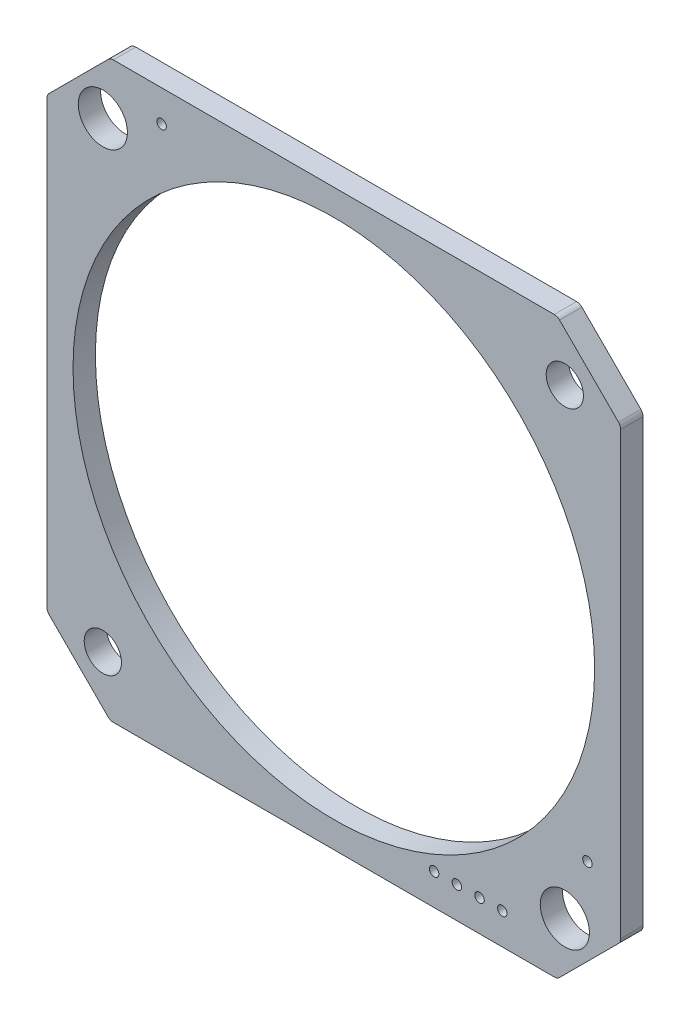
ISO-10303-21;
HEADER;
FILE_DESCRIPTION(('STEP AP214'),'2;1');
FILE_NAME('part.step','',(''),(''),'','','');
FILE_SCHEMA(('AUTOMOTIVE_DESIGN { 1 0 10303 214 1 1 1 1 }'));
ENDSEC;
DATA;
#1=APPLICATION_CONTEXT('core data for automotive mechanical design processes');
#2=APPLICATION_PROTOCOL_DEFINITION('international standard','automotive_design',2000,#1);
#3=PRODUCT_CONTEXT('',#1,'mechanical');
#4=PRODUCT('Part','Part','',(#3));
#5=PRODUCT_RELATED_PRODUCT_CATEGORY('part','',(#4));
#6=PRODUCT_DEFINITION_FORMATION('','',#4);
#7=PRODUCT_DEFINITION_CONTEXT('part definition',#1,'design');
#8=PRODUCT_DEFINITION('design','',#6,#7);
#9=PRODUCT_DEFINITION_SHAPE('','',#8);
#10=(LENGTH_UNIT() NAMED_UNIT(*) SI_UNIT(.MILLI.,.METRE.));
#11=(NAMED_UNIT(*) PLANE_ANGLE_UNIT() SI_UNIT($,.RADIAN.));
#12=(NAMED_UNIT(*) SI_UNIT($,.STERADIAN.) SOLID_ANGLE_UNIT());
#13=UNCERTAINTY_MEASURE_WITH_UNIT(LENGTH_MEASURE(1.E-05),#10,'distance_accuracy_value','');
#14=(GEOMETRIC_REPRESENTATION_CONTEXT(3) GLOBAL_UNCERTAINTY_ASSIGNED_CONTEXT((#13)) GLOBAL_UNIT_ASSIGNED_CONTEXT((#10,
#11,#12)) REPRESENTATION_CONTEXT('',''));
#15=CARTESIAN_POINT('',(0.,0.,0.));
#16=DIRECTION('',(0.,0.,1.));
#17=DIRECTION('',(1.,0.,0.));
#18=AXIS2_PLACEMENT_3D('',#15,#16,#17);
#19=CARTESIAN_POINT('',(0.,0.,-0.75));
#20=DIRECTION('',(0.,0.,1.));
#21=DIRECTION('',(1.,0.,0.));
#22=AXIS2_PLACEMENT_3D('',#19,#20,#21);
#23=PLANE('',#22);
#24=CARTESIAN_POINT('',(-18.75,14.79289321881,-0.75));
#25=DIRECTION('',(0.,0.,-1.));
#26=DIRECTION('',(-1.,0.,0.));
#27=AXIS2_PLACEMENT_3D('',#24,#25,#26);
#28=CIRCLE('',#27,0.5);
#29=CARTESIAN_POINT('',(-19.25,14.79289321881,-0.75));
#30=VERTEX_POINT('',#29);
#31=CARTESIAN_POINT('',(-19.10355339059,15.14644660941,-0.75));
#32=VERTEX_POINT('',#31);
#33=EDGE_CURVE('E10',#30,#32,#28,.T.);
#34=ORIENTED_EDGE('',*,*,#33,.T.);
#35=DIRECTION('',(-0.707106781186598,-0.707106781186498,0.));
#36=VECTOR('',#35,1.);
#37=CARTESIAN_POINT('',(-15.14644660941,19.10355339059,-0.75));
#38=LINE('',#37,#36);
#39=CARTESIAN_POINT('',(-15.14644660941,19.10355339059,-0.75));
#40=VERTEX_POINT('',#39);
#41=EDGE_CURVE('E35',#40,#32,#38,.T.);
#42=ORIENTED_EDGE('',*,*,#41,.F.);
#43=CARTESIAN_POINT('',(-14.79289321881,18.75,-0.75));
#44=DIRECTION('',(0.,0.,-1.));
#45=DIRECTION('',(-0.707106781186498,0.707106781186598,0.));
#46=AXIS2_PLACEMENT_3D('',#43,#44,#45);
#47=CIRCLE('',#46,0.5);
#48=CARTESIAN_POINT('',(-14.79289321881,19.25,-0.75));
#49=VERTEX_POINT('',#48);
#50=EDGE_CURVE('E26',#40,#49,#47,.T.);
#51=ORIENTED_EDGE('',*,*,#50,.T.);
#52=DIRECTION('',(-1.,0.,0.));
#53=VECTOR('',#52,1.);
#54=CARTESIAN_POINT('',(14.79289321881,19.25,-0.75));
#55=LINE('',#54,#53);
#56=CARTESIAN_POINT('',(14.79289321881,19.25,-0.75));
#57=VERTEX_POINT('',#56);
#58=EDGE_CURVE('E169',#57,#49,#55,.T.);
#59=ORIENTED_EDGE('',*,*,#58,.F.);
#60=CARTESIAN_POINT('',(14.79289321881,18.75,-0.75));
#61=DIRECTION('',(0.,0.,-1.));
#62=DIRECTION('',(0.,1.,0.));
#63=AXIS2_PLACEMENT_3D('',#60,#61,#62);
#64=CIRCLE('',#63,0.5);
#65=CARTESIAN_POINT('',(15.14644660941,19.10355339059,-0.75));
#66=VERTEX_POINT('',#65);
#67=EDGE_CURVE('E447',#57,#66,#64,.T.);
#68=ORIENTED_EDGE('',*,*,#67,.T.);
#69=DIRECTION('',(-0.707106781186498,0.707106781186598,0.));
#70=VECTOR('',#69,1.);
#71=CARTESIAN_POINT('',(19.10355339059,15.14644660941,-0.75));
#72=LINE('',#71,#70);
#73=CARTESIAN_POINT('',(19.10355339059,15.14644660941,-0.75));
#74=VERTEX_POINT('',#73);
#75=EDGE_CURVE('E173',#74,#66,#72,.T.);
#76=ORIENTED_EDGE('',*,*,#75,.F.);
#77=CARTESIAN_POINT('',(18.75,14.79289321881,-0.75));
#78=DIRECTION('',(0.,0.,-1.));
#79=DIRECTION('',(0.707106781186598,0.707106781186498,0.));
#80=AXIS2_PLACEMENT_3D('',#77,#78,#79);
#81=CIRCLE('',#80,0.5);
#82=CARTESIAN_POINT('',(19.25,14.79289321881,-0.75));
#83=VERTEX_POINT('',#82);
#84=EDGE_CURVE('E440',#74,#83,#81,.T.);
#85=ORIENTED_EDGE('',*,*,#84,.T.);
#86=DIRECTION('',(0.,1.,0.));
#87=VECTOR('',#86,1.);
#88=CARTESIAN_POINT('',(19.25,-14.79289321881,-0.75));
#89=LINE('',#88,#87);
#90=CARTESIAN_POINT('',(19.25,-14.79289321881,-0.75));
#91=VERTEX_POINT('',#90);
#92=EDGE_CURVE('E183',#91,#83,#89,.T.);
#93=ORIENTED_EDGE('',*,*,#92,.F.);
#94=CARTESIAN_POINT('',(18.75,-14.79289321881,-0.75));
#95=DIRECTION('',(0.,0.,-1.));
#96=DIRECTION('',(1.,0.,0.));
#97=AXIS2_PLACEMENT_3D('',#94,#95,#96);
#98=CIRCLE('',#97,0.5);
#99=CARTESIAN_POINT('',(19.10355339059,-15.14644660941,-0.75));
#100=VERTEX_POINT('',#99);
#101=EDGE_CURVE('E436',#91,#100,#98,.T.);
#102=ORIENTED_EDGE('',*,*,#101,.T.);
#103=DIRECTION('',(0.707106781186498,0.707106781186598,0.));
#104=VECTOR('',#103,1.);
#105=CARTESIAN_POINT('',(15.14644660941,-19.10355339059,-0.75));
#106=LINE('',#105,#104);
#107=CARTESIAN_POINT('',(15.14644660941,-19.10355339059,-0.75));
#108=VERTEX_POINT('',#107);
#109=EDGE_CURVE('E190',#108,#100,#106,.T.);
#110=ORIENTED_EDGE('',*,*,#109,.F.);
#111=CARTESIAN_POINT('',(14.79289321881,-18.75,-0.75));
#112=DIRECTION('',(0.,0.,-1.));
#113=DIRECTION('',(0.707106781186598,-0.707106781186498,0.));
#114=AXIS2_PLACEMENT_3D('',#111,#112,#113);
#115=CIRCLE('',#114,0.5);
#116=CARTESIAN_POINT('',(14.79289321881,-19.25,-0.75));
#117=VERTEX_POINT('',#116);
#118=EDGE_CURVE('E435',#108,#117,#115,.T.);
#119=ORIENTED_EDGE('',*,*,#118,.T.);
#120=DIRECTION('',(1.,0.,0.));
#121=VECTOR('',#120,1.);
#122=CARTESIAN_POINT('',(-14.79289321881,-19.25,-0.75));
#123=LINE('',#122,#121);
#124=CARTESIAN_POINT('',(-14.79289321881,-19.25,-0.75));
#125=VERTEX_POINT('',#124);
#126=EDGE_CURVE('E196',#125,#117,#123,.T.);
#127=ORIENTED_EDGE('',*,*,#126,.F.);
#128=CARTESIAN_POINT('',(-14.79289321881,-18.75,-0.75));
#129=DIRECTION('',(0.,0.,-1.));
#130=DIRECTION('',(0.,-1.,0.));
#131=AXIS2_PLACEMENT_3D('',#128,#129,#130);
#132=CIRCLE('',#131,0.5);
#133=CARTESIAN_POINT('',(-15.14644660941,-19.10355339059,-0.75));
#134=VERTEX_POINT('',#133);
#135=EDGE_CURVE('E211',#125,#134,#132,.T.);
#136=ORIENTED_EDGE('',*,*,#135,.T.);
#137=DIRECTION('',(0.707106781186498,-0.707106781186598,0.));
#138=VECTOR('',#137,1.);
#139=CARTESIAN_POINT('',(-19.10355339059,-15.14644660941,-0.75));
#140=LINE('',#139,#138);
#141=CARTESIAN_POINT('',(-19.10355339059,-15.14644660941,-0.75));
#142=VERTEX_POINT('',#141);
#143=EDGE_CURVE('E204',#142,#134,#140,.T.);
#144=ORIENTED_EDGE('',*,*,#143,.F.);
#145=CARTESIAN_POINT('',(-18.75,-14.79289321881,-0.75));
#146=DIRECTION('',(0.,0.,-1.));
#147=DIRECTION('',(-0.707106781186598,-0.707106781186498,0.));
#148=AXIS2_PLACEMENT_3D('',#145,#146,#147);
#149=CIRCLE('',#148,0.5);
#150=CARTESIAN_POINT('',(-19.25,-14.79289321881,-0.75));
#151=VERTEX_POINT('',#150);
#152=EDGE_CURVE('E212',#142,#151,#149,.T.);
#153=ORIENTED_EDGE('',*,*,#152,.T.);
#154=DIRECTION('',(0.,-1.,0.));
#155=VECTOR('',#154,1.);
#156=CARTESIAN_POINT('',(-19.25,14.79289321881,-0.75));
#157=LINE('',#156,#155);
#158=EDGE_CURVE('E150',#30,#151,#157,.T.);
#159=ORIENTED_EDGE('',*,*,#158,.F.);
#160=EDGE_LOOP('',(#34,#42,#51,#59,#68,#76,#85,#93,#102,#110,#119,#127,#136,#144,#153,#159));
#161=FACE_BOUND('',#160,.T.);
#162=CARTESIAN_POINT('',(8.254898,-17.14503,-0.75));
#163=DIRECTION('',(0.,0.,-1.));
#164=DIRECTION('',(-1.,0.,0.));
#165=AXIS2_PLACEMENT_3D('',#162,#163,#164);
#166=CIRCLE('',#165,0.3175);
#167=CARTESIAN_POINT('',(7.937398,-17.14503,-0.75));
#168=VERTEX_POINT('',#167);
#169=EDGE_CURVE('E216',#168,#168,#166,.T.);
#170=ORIENTED_EDGE('',*,*,#169,.F.);
#171=EDGE_LOOP('',(#170));
#172=FACE_BOUND('',#171,.T.);
#173=CARTESIAN_POINT('',(17.017898,-11.43003,-0.75));
#174=DIRECTION('',(0.,0.,-1.));
#175=DIRECTION('',(-1.,0.,0.));
#176=AXIS2_PLACEMENT_3D('',#173,#174,#175);
#177=CIRCLE('',#176,0.3175);
#178=CARTESIAN_POINT('',(16.700398,-11.43003,-0.75));
#179=VERTEX_POINT('',#178);
#180=EDGE_CURVE('E220',#179,#179,#177,.T.);
#181=ORIENTED_EDGE('',*,*,#180,.F.);
#182=EDGE_LOOP('',(#181));
#183=FACE_BOUND('',#182,.T.);
#184=CARTESIAN_POINT('',(-11.557102,17.14497,-0.75));
#185=DIRECTION('',(0.,0.,-1.));
#186=DIRECTION('',(-1.,0.,0.));
#187=AXIS2_PLACEMENT_3D('',#184,#185,#186);
#188=CIRCLE('',#187,0.3175);
#189=CARTESIAN_POINT('',(-11.874602,17.14497,-0.75));
#190=VERTEX_POINT('',#189);
#191=EDGE_CURVE('E223',#190,#190,#188,.T.);
#192=ORIENTED_EDGE('',*,*,#191,.F.);
#193=EDGE_LOOP('',(#192));
#194=FACE_BOUND('',#193,.T.);
#195=CARTESIAN_POINT('',(9.778898,-17.14503,-0.75));
#196=DIRECTION('',(0.,0.,-1.));
#197=DIRECTION('',(-1.,0.,0.));
#198=AXIS2_PLACEMENT_3D('',#195,#196,#197);
#199=CIRCLE('',#198,0.3175);
#200=CARTESIAN_POINT('',(9.461398,-17.14503,-0.75));
#201=VERTEX_POINT('',#200);
#202=EDGE_CURVE('E226',#201,#201,#199,.T.);
#203=ORIENTED_EDGE('',*,*,#202,.F.);
#204=EDGE_LOOP('',(#203));
#205=FACE_BOUND('',#204,.T.);
#206=CARTESIAN_POINT('',(11.302898,-17.14503,-0.75));
#207=DIRECTION('',(0.,0.,-1.));
#208=DIRECTION('',(-1.,0.,0.));
#209=AXIS2_PLACEMENT_3D('',#206,#207,#208);
#210=CIRCLE('',#209,0.3175);
#211=CARTESIAN_POINT('',(10.985398,-17.14503,-0.75));
#212=VERTEX_POINT('',#211);
#213=EDGE_CURVE('E229',#212,#212,#210,.T.);
#214=ORIENTED_EDGE('',*,*,#213,.F.);
#215=EDGE_LOOP('',(#214));
#216=FACE_BOUND('',#215,.T.);
#217=CARTESIAN_POINT('',(-15.5,15.5,-0.75));
#218=DIRECTION('',(0.,0.,-1.));
#219=DIRECTION('',(-1.,0.,0.));
#220=AXIS2_PLACEMENT_3D('',#217,#218,#219);
#221=CIRCLE('',#220,1.65);
#222=CARTESIAN_POINT('',(-17.15,15.5,-0.75));
#223=VERTEX_POINT('',#222);
#224=EDGE_CURVE('E232',#223,#223,#221,.T.);
#225=ORIENTED_EDGE('',*,*,#224,.F.);
#226=EDGE_LOOP('',(#225));
#227=FACE_BOUND('',#226,.T.);
#228=CARTESIAN_POINT('',(15.5,-15.5,-0.75));
#229=DIRECTION('',(0.,0.,-1.));
#230=DIRECTION('',(-1.,0.,0.));
#231=AXIS2_PLACEMENT_3D('',#228,#229,#230);
#232=CIRCLE('',#231,1.65);
#233=CARTESIAN_POINT('',(13.85,-15.5,-0.75));
#234=VERTEX_POINT('',#233);
#235=EDGE_CURVE('E235',#234,#234,#232,.T.);
#236=ORIENTED_EDGE('',*,*,#235,.F.);
#237=EDGE_LOOP('',(#236));
#238=FACE_BOUND('',#237,.T.);
#239=CARTESIAN_POINT('',(6.730898,-17.14503,-0.75));
#240=DIRECTION('',(0.,0.,-1.));
#241=DIRECTION('',(-1.,0.,0.));
#242=AXIS2_PLACEMENT_3D('',#239,#240,#241);
#243=CIRCLE('',#242,0.3175);
#244=CARTESIAN_POINT('',(6.413398,-17.14503,-0.75));
#245=VERTEX_POINT('',#244);
#246=EDGE_CURVE('E238',#245,#245,#243,.T.);
#247=ORIENTED_EDGE('',*,*,#246,.F.);
#248=EDGE_LOOP('',(#247));
#249=FACE_BOUND('',#248,.T.);
#250=CARTESIAN_POINT('',(15.5,15.5,-0.75));
#251=DIRECTION('',(0.,0.,-1.));
#252=DIRECTION('',(1.,0.,0.));
#253=AXIS2_PLACEMENT_3D('',#250,#251,#252);
#254=CIRCLE('',#253,1.25);
#255=CARTESIAN_POINT('',(16.75,15.5,-0.75));
#256=VERTEX_POINT('',#255);
#257=EDGE_CURVE('E242',#256,#256,#254,.T.);
#258=ORIENTED_EDGE('',*,*,#257,.F.);
#259=EDGE_LOOP('',(#258));
#260=FACE_BOUND('',#259,.T.);
#261=CARTESIAN_POINT('',(-15.5,-15.5,-0.75));
#262=DIRECTION('',(0.,0.,-1.));
#263=DIRECTION('',(1.,0.,0.));
#264=AXIS2_PLACEMENT_3D('',#261,#262,#263);
#265=CIRCLE('',#264,1.25);
#266=CARTESIAN_POINT('',(-14.25,-15.5,-0.75));
#267=VERTEX_POINT('',#266);
#268=EDGE_CURVE('E149',#267,#267,#265,.T.);
#269=ORIENTED_EDGE('',*,*,#268,.F.);
#270=EDGE_LOOP('',(#269));
#271=FACE_BOUND('',#270,.T.);
#272=CARTESIAN_POINT('',(0.,0.,-0.75));
#273=DIRECTION('',(0.,0.,-1.));
#274=DIRECTION('',(-1.,0.,0.));
#275=AXIS2_PLACEMENT_3D('',#272,#273,#274);
#276=CIRCLE('',#275,17.5);
#277=CARTESIAN_POINT('',(-17.5,0.,-0.75));
#278=VERTEX_POINT('',#277);
#279=EDGE_CURVE('E214',#278,#278,#276,.T.);
#280=ORIENTED_EDGE('',*,*,#279,.F.);
#281=EDGE_LOOP('',(#280));
#282=FACE_BOUND('',#281,.T.);
#283=ADVANCED_FACE('F16',(#161,#172,#183,#194,#205,#216,#227,#238,#249,#260,#271,#282),#23,.F.);
#284=CARTESIAN_POINT('',(0.,0.,-0.75));
#285=DIRECTION('',(0.,0.,1.));
#286=DIRECTION('',(1.,0.,0.));
#287=AXIS2_PLACEMENT_3D('',#284,#285,#286);
#288=CYLINDRICAL_SURFACE('',#287,17.5);
#289=CARTESIAN_POINT('',(0.,0.,0.75));
#290=DIRECTION('',(0.,0.,-1.));
#291=DIRECTION('',(1.,0.,0.));
#292=AXIS2_PLACEMENT_3D('',#289,#290,#291);
#293=CIRCLE('',#292,17.5);
#294=CARTESIAN_POINT('',(17.5,0.,0.75));
#295=VERTEX_POINT('',#294);
#296=EDGE_CURVE('E219',#295,#295,#293,.T.);
#297=ORIENTED_EDGE('',*,*,#296,.F.);
#298=EDGE_LOOP('',(#297));
#299=FACE_BOUND('',#298,.T.);
#300=ORIENTED_EDGE('',*,*,#279,.T.);
#301=EDGE_LOOP('',(#300));
#302=FACE_BOUND('',#301,.T.);
#303=ADVANCED_FACE('F320',(#299,#302),#288,.F.);
#304=CARTESIAN_POINT('',(0.,0.,0.75));
#305=DIRECTION('',(0.,0.,1.));
#306=DIRECTION('',(1.,0.,0.));
#307=AXIS2_PLACEMENT_3D('',#304,#305,#306);
#308=PLANE('',#307);
#309=CARTESIAN_POINT('',(-18.75,-14.79289321881,0.75));
#310=DIRECTION('',(0.,0.,1.));
#311=DIRECTION('',(-1.,0.,0.));
#312=AXIS2_PLACEMENT_3D('',#309,#310,#311);
#313=CIRCLE('',#312,0.5);
#314=CARTESIAN_POINT('',(-19.25,-14.79289321881,0.75));
#315=VERTEX_POINT('',#314);
#316=CARTESIAN_POINT('',(-19.10355339059,-15.14644660941,0.75));
#317=VERTEX_POINT('',#316);
#318=EDGE_CURVE('E247',#315,#317,#313,.T.);
#319=ORIENTED_EDGE('',*,*,#318,.T.);
#320=DIRECTION('',(0.707106781186498,-0.707106781186598,0.));
#321=VECTOR('',#320,1.);
#322=CARTESIAN_POINT('',(-19.10355339059,-15.14644660941,0.75));
#323=LINE('',#322,#321);
#324=CARTESIAN_POINT('',(-15.14644660941,-19.10355339059,0.75));
#325=VERTEX_POINT('',#324);
#326=EDGE_CURVE('E252',#317,#325,#323,.T.);
#327=ORIENTED_EDGE('',*,*,#326,.T.);
#328=CARTESIAN_POINT('',(-14.79289321881,-18.75,0.75));
#329=DIRECTION('',(0.,0.,1.));
#330=DIRECTION('',(-0.707106781186598,-0.707106781186498,0.));
#331=AXIS2_PLACEMENT_3D('',#328,#329,#330);
#332=CIRCLE('',#331,0.5);
#333=CARTESIAN_POINT('',(-14.79289321881,-19.25,0.75));
#334=VERTEX_POINT('',#333);
#335=EDGE_CURVE('E255',#325,#334,#332,.T.);
#336=ORIENTED_EDGE('',*,*,#335,.T.);
#337=DIRECTION('',(1.,0.,0.));
#338=VECTOR('',#337,1.);
#339=CARTESIAN_POINT('',(-14.79289321881,-19.25,0.75));
#340=LINE('',#339,#338);
#341=CARTESIAN_POINT('',(14.79289321881,-19.25,0.75));
#342=VERTEX_POINT('',#341);
#343=EDGE_CURVE('E258',#334,#342,#340,.T.);
#344=ORIENTED_EDGE('',*,*,#343,.T.);
#345=CARTESIAN_POINT('',(14.79289321881,-18.75,0.75));
#346=DIRECTION('',(0.,0.,1.));
#347=DIRECTION('',(0.,-1.,0.));
#348=AXIS2_PLACEMENT_3D('',#345,#346,#347);
#349=CIRCLE('',#348,0.5);
#350=CARTESIAN_POINT('',(15.14644660941,-19.10355339059,0.75));
#351=VERTEX_POINT('',#350);
#352=EDGE_CURVE('E261',#342,#351,#349,.T.);
#353=ORIENTED_EDGE('',*,*,#352,.T.);
#354=DIRECTION('',(0.707106781186498,0.707106781186598,0.));
#355=VECTOR('',#354,1.);
#356=CARTESIAN_POINT('',(15.14644660941,-19.10355339059,0.75));
#357=LINE('',#356,#355);
#358=CARTESIAN_POINT('',(19.10355339059,-15.14644660941,0.75));
#359=VERTEX_POINT('',#358);
#360=EDGE_CURVE('E264',#351,#359,#357,.T.);
#361=ORIENTED_EDGE('',*,*,#360,.T.);
#362=CARTESIAN_POINT('',(18.75,-14.79289321881,0.75));
#363=DIRECTION('',(0.,0.,1.));
#364=DIRECTION('',(0.707106781186598,-0.707106781186498,0.));
#365=AXIS2_PLACEMENT_3D('',#362,#363,#364);
#366=CIRCLE('',#365,0.5);
#367=CARTESIAN_POINT('',(19.25,-14.79289321881,0.75));
#368=VERTEX_POINT('',#367);
#369=EDGE_CURVE('E267',#359,#368,#366,.T.);
#370=ORIENTED_EDGE('',*,*,#369,.T.);
#371=DIRECTION('',(0.,1.,0.));
#372=VECTOR('',#371,1.);
#373=CARTESIAN_POINT('',(19.25,-14.79289321881,0.75));
#374=LINE('',#373,#372);
#375=CARTESIAN_POINT('',(19.25,14.79289321881,0.75));
#376=VERTEX_POINT('',#375);
#377=EDGE_CURVE('E270',#368,#376,#374,.T.);
#378=ORIENTED_EDGE('',*,*,#377,.T.);
#379=CARTESIAN_POINT('',(18.75,14.79289321881,0.75));
#380=DIRECTION('',(0.,0.,1.));
#381=DIRECTION('',(1.,0.,0.));
#382=AXIS2_PLACEMENT_3D('',#379,#380,#381);
#383=CIRCLE('',#382,0.5);
#384=CARTESIAN_POINT('',(19.10355339059,15.14644660941,0.75));
#385=VERTEX_POINT('',#384);
#386=EDGE_CURVE('E273',#376,#385,#383,.T.);
#387=ORIENTED_EDGE('',*,*,#386,.T.);
#388=DIRECTION('',(-0.707106781186498,0.707106781186598,0.));
#389=VECTOR('',#388,1.);
#390=CARTESIAN_POINT('',(19.10355339059,15.14644660941,0.75));
#391=LINE('',#390,#389);
#392=CARTESIAN_POINT('',(15.14644660941,19.10355339059,0.75));
#393=VERTEX_POINT('',#392);
#394=EDGE_CURVE('E276',#385,#393,#391,.T.);
#395=ORIENTED_EDGE('',*,*,#394,.T.);
#396=CARTESIAN_POINT('',(14.79289321881,18.75,0.75));
#397=DIRECTION('',(0.,0.,1.));
#398=DIRECTION('',(0.707106781186598,0.707106781186498,0.));
#399=AXIS2_PLACEMENT_3D('',#396,#397,#398);
#400=CIRCLE('',#399,0.5);
#401=CARTESIAN_POINT('',(14.79289321881,19.25,0.75));
#402=VERTEX_POINT('',#401);
#403=EDGE_CURVE('E279',#393,#402,#400,.T.);
#404=ORIENTED_EDGE('',*,*,#403,.T.);
#405=DIRECTION('',(-1.,0.,0.));
#406=VECTOR('',#405,1.);
#407=CARTESIAN_POINT('',(14.79289321881,19.25,0.75));
#408=LINE('',#407,#406);
#409=CARTESIAN_POINT('',(-14.79289321881,19.25,0.75));
#410=VERTEX_POINT('',#409);
#411=EDGE_CURVE('E282',#402,#410,#408,.T.);
#412=ORIENTED_EDGE('',*,*,#411,.T.);
#413=CARTESIAN_POINT('',(-14.79289321881,18.75,0.75));
#414=DIRECTION('',(0.,0.,1.));
#415=DIRECTION('',(0.,1.,0.));
#416=AXIS2_PLACEMENT_3D('',#413,#414,#415);
#417=CIRCLE('',#416,0.5);
#418=CARTESIAN_POINT('',(-15.14644660941,19.10355339059,0.75));
#419=VERTEX_POINT('',#418);
#420=EDGE_CURVE('E285',#410,#419,#417,.T.);
#421=ORIENTED_EDGE('',*,*,#420,.T.);
#422=DIRECTION('',(-0.707106781186598,-0.707106781186498,0.));
#423=VECTOR('',#422,1.);
#424=CARTESIAN_POINT('',(-15.14644660941,19.10355339059,0.75));
#425=LINE('',#424,#423);
#426=CARTESIAN_POINT('',(-19.10355339059,15.14644660941,0.75));
#427=VERTEX_POINT('',#426);
#428=EDGE_CURVE('E145',#419,#427,#425,.T.);
#429=ORIENTED_EDGE('',*,*,#428,.T.);
#430=CARTESIAN_POINT('',(-18.75,14.79289321881,0.75));
#431=DIRECTION('',(0.,0.,1.));
#432=DIRECTION('',(-0.707106781186498,0.707106781186598,0.));
#433=AXIS2_PLACEMENT_3D('',#430,#431,#432);
#434=CIRCLE('',#433,0.5);
#435=CARTESIAN_POINT('',(-19.25,14.79289321881,0.75));
#436=VERTEX_POINT('',#435);
#437=EDGE_CURVE('E126',#427,#436,#434,.T.);
#438=ORIENTED_EDGE('',*,*,#437,.T.);
#439=DIRECTION('',(0.,-1.,0.));
#440=VECTOR('',#439,1.);
#441=CARTESIAN_POINT('',(-19.25,14.79289321881,0.75));
#442=LINE('',#441,#440);
#443=EDGE_CURVE('E132',#436,#315,#442,.T.);
#444=ORIENTED_EDGE('',*,*,#443,.T.);
#445=EDGE_LOOP('',(#319,#327,#336,#344,#353,#361,#370,#378,#387,#395,#404,#412,#421,#429,#438,#444));
#446=FACE_BOUND('',#445,.T.);
#447=CARTESIAN_POINT('',(8.254898,-17.14503,0.75));
#448=DIRECTION('',(0.,0.,-1.));
#449=DIRECTION('',(-1.,0.,0.));
#450=AXIS2_PLACEMENT_3D('',#447,#448,#449);
#451=CIRCLE('',#450,0.3175);
#452=CARTESIAN_POINT('',(7.937398,-17.14503,0.75));
#453=VERTEX_POINT('',#452);
#454=EDGE_CURVE('E140',#453,#453,#451,.T.);
#455=ORIENTED_EDGE('',*,*,#454,.T.);
#456=EDGE_LOOP('',(#455));
#457=FACE_BOUND('',#456,.T.);
#458=CARTESIAN_POINT('',(17.017898,-11.43003,0.75));
#459=DIRECTION('',(0.,0.,-1.));
#460=DIRECTION('',(-1.,0.,0.));
#461=AXIS2_PLACEMENT_3D('',#458,#459,#460);
#462=CIRCLE('',#461,0.3175);
#463=CARTESIAN_POINT('',(16.700398,-11.43003,0.75));
#464=VERTEX_POINT('',#463);
#465=EDGE_CURVE('E290',#464,#464,#462,.T.);
#466=ORIENTED_EDGE('',*,*,#465,.T.);
#467=EDGE_LOOP('',(#466));
#468=FACE_BOUND('',#467,.T.);
#469=CARTESIAN_POINT('',(-11.557102,17.14497,0.75));
#470=DIRECTION('',(0.,0.,-1.));
#471=DIRECTION('',(-1.,0.,0.));
#472=AXIS2_PLACEMENT_3D('',#469,#470,#471);
#473=CIRCLE('',#472,0.3175);
#474=CARTESIAN_POINT('',(-11.874602,17.14497,0.75));
#475=VERTEX_POINT('',#474);
#476=EDGE_CURVE('E293',#475,#475,#473,.T.);
#477=ORIENTED_EDGE('',*,*,#476,.T.);
#478=EDGE_LOOP('',(#477));
#479=FACE_BOUND('',#478,.T.);
#480=CARTESIAN_POINT('',(9.778898,-17.14503,0.75));
#481=DIRECTION('',(0.,0.,-1.));
#482=DIRECTION('',(-1.,0.,0.));
#483=AXIS2_PLACEMENT_3D('',#480,#481,#482);
#484=CIRCLE('',#483,0.3175);
#485=CARTESIAN_POINT('',(9.461398,-17.14503,0.75));
#486=VERTEX_POINT('',#485);
#487=EDGE_CURVE('E296',#486,#486,#484,.T.);
#488=ORIENTED_EDGE('',*,*,#487,.T.);
#489=EDGE_LOOP('',(#488));
#490=FACE_BOUND('',#489,.T.);
#491=CARTESIAN_POINT('',(11.302898,-17.14503,0.75));
#492=DIRECTION('',(0.,0.,-1.));
#493=DIRECTION('',(-1.,0.,0.));
#494=AXIS2_PLACEMENT_3D('',#491,#492,#493);
#495=CIRCLE('',#494,0.3175);
#496=CARTESIAN_POINT('',(10.985398,-17.14503,0.75));
#497=VERTEX_POINT('',#496);
#498=EDGE_CURVE('E299',#497,#497,#495,.T.);
#499=ORIENTED_EDGE('',*,*,#498,.T.);
#500=EDGE_LOOP('',(#499));
#501=FACE_BOUND('',#500,.T.);
#502=CARTESIAN_POINT('',(-15.5,15.5,0.75));
#503=DIRECTION('',(0.,0.,-1.));
#504=DIRECTION('',(-1.,0.,0.));
#505=AXIS2_PLACEMENT_3D('',#502,#503,#504);
#506=CIRCLE('',#505,1.65);
#507=CARTESIAN_POINT('',(-17.15,15.5,0.75));
#508=VERTEX_POINT('',#507);
#509=EDGE_CURVE('E302',#508,#508,#506,.T.);
#510=ORIENTED_EDGE('',*,*,#509,.T.);
#511=EDGE_LOOP('',(#510));
#512=FACE_BOUND('',#511,.T.);
#513=CARTESIAN_POINT('',(15.5,-15.5,0.75));
#514=DIRECTION('',(0.,0.,-1.));
#515=DIRECTION('',(-1.,0.,0.));
#516=AXIS2_PLACEMENT_3D('',#513,#514,#515);
#517=CIRCLE('',#516,1.65);
#518=CARTESIAN_POINT('',(13.85,-15.5,0.75));
#519=VERTEX_POINT('',#518);
#520=EDGE_CURVE('E305',#519,#519,#517,.T.);
#521=ORIENTED_EDGE('',*,*,#520,.T.);
#522=EDGE_LOOP('',(#521));
#523=FACE_BOUND('',#522,.T.);
#524=CARTESIAN_POINT('',(6.730898,-17.14503,0.75));
#525=DIRECTION('',(0.,0.,-1.));
#526=DIRECTION('',(-1.,0.,0.));
#527=AXIS2_PLACEMENT_3D('',#524,#525,#526);
#528=CIRCLE('',#527,0.3175);
#529=CARTESIAN_POINT('',(6.413398,-17.14503,0.75));
#530=VERTEX_POINT('',#529);
#531=EDGE_CURVE('E250',#530,#530,#528,.T.);
#532=ORIENTED_EDGE('',*,*,#531,.T.);
#533=EDGE_LOOP('',(#532));
#534=FACE_BOUND('',#533,.T.);
#535=CARTESIAN_POINT('',(15.5,15.5,0.75));
#536=DIRECTION('',(0.,0.,1.));
#537=DIRECTION('',(-1.,0.,0.));
#538=AXIS2_PLACEMENT_3D('',#535,#536,#537);
#539=CIRCLE('',#538,1.25);
#540=CARTESIAN_POINT('',(14.25,15.5,0.75));
#541=VERTEX_POINT('',#540);
#542=EDGE_CURVE('E241',#541,#541,#539,.T.);
#543=ORIENTED_EDGE('',*,*,#542,.F.);
#544=EDGE_LOOP('',(#543));
#545=FACE_BOUND('',#544,.T.);
#546=CARTESIAN_POINT('',(-15.5,-15.5,0.75));
#547=DIRECTION('',(0.,0.,1.));
#548=DIRECTION('',(-1.,0.,0.));
#549=AXIS2_PLACEMENT_3D('',#546,#547,#548);
#550=CIRCLE('',#549,1.25);
#551=CARTESIAN_POINT('',(-16.75,-15.5,0.75));
#552=VERTEX_POINT('',#551);
#553=EDGE_CURVE('E153',#552,#552,#550,.T.);
#554=ORIENTED_EDGE('',*,*,#553,.F.);
#555=EDGE_LOOP('',(#554));
#556=FACE_BOUND('',#555,.T.);
#557=ORIENTED_EDGE('',*,*,#296,.T.);
#558=EDGE_LOOP('',(#557));
#559=FACE_BOUND('',#558,.T.);
#560=ADVANCED_FACE('F142',(#446,#457,#468,#479,#490,#501,#512,#523,#534,#545,#556,#559),#308,.T.);
#561=CARTESIAN_POINT('',(8.254898,-17.14503,-0.75));
#562=DIRECTION('',(0.,0.,1.));
#563=DIRECTION('',(1.,0.,0.));
#564=AXIS2_PLACEMENT_3D('',#561,#562,#563);
#565=CYLINDRICAL_SURFACE('',#564,0.3175);
#566=ORIENTED_EDGE('',*,*,#454,.F.);
#567=EDGE_LOOP('',(#566));
#568=FACE_BOUND('',#567,.T.);
#569=ORIENTED_EDGE('',*,*,#169,.T.);
#570=EDGE_LOOP('',(#569));
#571=FACE_BOUND('',#570,.T.);
#572=ADVANCED_FACE('F319',(#568,#571),#565,.F.);
#573=CARTESIAN_POINT('',(17.017898,-11.43003,-0.75));
#574=DIRECTION('',(0.,0.,1.));
#575=DIRECTION('',(1.,0.,0.));
#576=AXIS2_PLACEMENT_3D('',#573,#574,#575);
#577=CYLINDRICAL_SURFACE('',#576,0.3175);
#578=ORIENTED_EDGE('',*,*,#465,.F.);
#579=EDGE_LOOP('',(#578));
#580=FACE_BOUND('',#579,.T.);
#581=ORIENTED_EDGE('',*,*,#180,.T.);
#582=EDGE_LOOP('',(#581));
#583=FACE_BOUND('',#582,.T.);
#584=ADVANCED_FACE('F340',(#580,#583),#577,.F.);
#585=CARTESIAN_POINT('',(-11.557102,17.14497,-0.75));
#586=DIRECTION('',(0.,0.,1.));
#587=DIRECTION('',(1.,0.,0.));
#588=AXIS2_PLACEMENT_3D('',#585,#586,#587);
#589=CYLINDRICAL_SURFACE('',#588,0.3175);
#590=ORIENTED_EDGE('',*,*,#476,.F.);
#591=EDGE_LOOP('',(#590));
#592=FACE_BOUND('',#591,.T.);
#593=ORIENTED_EDGE('',*,*,#191,.T.);
#594=EDGE_LOOP('',(#593));
#595=FACE_BOUND('',#594,.T.);
#596=ADVANCED_FACE('F344',(#592,#595),#589,.F.);
#597=CARTESIAN_POINT('',(9.778898,-17.14503,-0.75));
#598=DIRECTION('',(0.,0.,1.));
#599=DIRECTION('',(1.,0.,0.));
#600=AXIS2_PLACEMENT_3D('',#597,#598,#599);
#601=CYLINDRICAL_SURFACE('',#600,0.3175);
#602=ORIENTED_EDGE('',*,*,#487,.F.);
#603=EDGE_LOOP('',(#602));
#604=FACE_BOUND('',#603,.T.);
#605=ORIENTED_EDGE('',*,*,#202,.T.);
#606=EDGE_LOOP('',(#605));
#607=FACE_BOUND('',#606,.T.);
#608=ADVANCED_FACE('F348',(#604,#607),#601,.F.);
#609=CARTESIAN_POINT('',(11.302898,-17.14503,-0.75));
#610=DIRECTION('',(0.,0.,1.));
#611=DIRECTION('',(1.,0.,0.));
#612=AXIS2_PLACEMENT_3D('',#609,#610,#611);
#613=CYLINDRICAL_SURFACE('',#612,0.3175);
#614=ORIENTED_EDGE('',*,*,#498,.F.);
#615=EDGE_LOOP('',(#614));
#616=FACE_BOUND('',#615,.T.);
#617=ORIENTED_EDGE('',*,*,#213,.T.);
#618=EDGE_LOOP('',(#617));
#619=FACE_BOUND('',#618,.T.);
#620=ADVANCED_FACE('F352',(#616,#619),#613,.F.);
#621=CARTESIAN_POINT('',(-15.5,15.5,-0.75));
#622=DIRECTION('',(0.,0.,1.));
#623=DIRECTION('',(1.,0.,0.));
#624=AXIS2_PLACEMENT_3D('',#621,#622,#623);
#625=CYLINDRICAL_SURFACE('',#624,1.65);
#626=ORIENTED_EDGE('',*,*,#509,.F.);
#627=EDGE_LOOP('',(#626));
#628=FACE_BOUND('',#627,.T.);
#629=ORIENTED_EDGE('',*,*,#224,.T.);
#630=EDGE_LOOP('',(#629));
#631=FACE_BOUND('',#630,.T.);
#632=ADVANCED_FACE('F356',(#628,#631),#625,.F.);
#633=CARTESIAN_POINT('',(15.5,-15.5,-0.75));
#634=DIRECTION('',(0.,0.,1.));
#635=DIRECTION('',(1.,0.,0.));
#636=AXIS2_PLACEMENT_3D('',#633,#634,#635);
#637=CYLINDRICAL_SURFACE('',#636,1.65);
#638=ORIENTED_EDGE('',*,*,#520,.F.);
#639=EDGE_LOOP('',(#638));
#640=FACE_BOUND('',#639,.T.);
#641=ORIENTED_EDGE('',*,*,#235,.T.);
#642=EDGE_LOOP('',(#641));
#643=FACE_BOUND('',#642,.T.);
#644=ADVANCED_FACE('F360',(#640,#643),#637,.F.);
#645=CARTESIAN_POINT('',(6.730898,-17.14503,-0.75));
#646=DIRECTION('',(0.,0.,1.));
#647=DIRECTION('',(1.,0.,0.));
#648=AXIS2_PLACEMENT_3D('',#645,#646,#647);
#649=CYLINDRICAL_SURFACE('',#648,0.3175);
#650=ORIENTED_EDGE('',*,*,#531,.F.);
#651=EDGE_LOOP('',(#650));
#652=FACE_BOUND('',#651,.T.);
#653=ORIENTED_EDGE('',*,*,#246,.T.);
#654=EDGE_LOOP('',(#653));
#655=FACE_BOUND('',#654,.T.);
#656=ADVANCED_FACE('F364',(#652,#655),#649,.F.);
#657=CARTESIAN_POINT('',(15.5,15.5,-0.75));
#658=DIRECTION('',(0.,0.,-1.));
#659=DIRECTION('',(-1.,0.,0.));
#660=AXIS2_PLACEMENT_3D('',#657,#658,#659);
#661=CYLINDRICAL_SURFACE('',#660,1.25);
#662=ORIENTED_EDGE('',*,*,#542,.T.);
#663=EDGE_LOOP('',(#662));
#664=FACE_BOUND('',#663,.T.);
#665=ORIENTED_EDGE('',*,*,#257,.T.);
#666=EDGE_LOOP('',(#665));
#667=FACE_BOUND('',#666,.T.);
#668=ADVANCED_FACE('F368',(#664,#667),#661,.F.);
#669=CARTESIAN_POINT('',(-15.5,-15.5,-0.75));
#670=DIRECTION('',(0.,0.,-1.));
#671=DIRECTION('',(-1.,0.,0.));
#672=AXIS2_PLACEMENT_3D('',#669,#670,#671);
#673=CYLINDRICAL_SURFACE('',#672,1.25);
#674=ORIENTED_EDGE('',*,*,#553,.T.);
#675=EDGE_LOOP('',(#674));
#676=FACE_BOUND('',#675,.T.);
#677=ORIENTED_EDGE('',*,*,#268,.T.);
#678=EDGE_LOOP('',(#677));
#679=FACE_BOUND('',#678,.T.);
#680=ADVANCED_FACE('F314',(#676,#679),#673,.F.);
#681=CARTESIAN_POINT('',(-19.25,15.,-0.75));
#682=DIRECTION('',(-1.,0.,0.));
#683=DIRECTION('',(0.,-1.,0.));
#684=AXIS2_PLACEMENT_3D('',#681,#682,#683);
#685=PLANE('',#684);
#686=DIRECTION('',(0.,0.,-1.));
#687=VECTOR('',#686,1.);
#688=CARTESIAN_POINT('',(-19.25,-14.79289321881,0.75));
#689=LINE('',#688,#687);
#690=EDGE_CURVE('E136',#315,#151,#689,.T.);
#691=ORIENTED_EDGE('',*,*,#690,.F.);
#692=ORIENTED_EDGE('',*,*,#443,.F.);
#693=DIRECTION('',(0.,0.,-1.));
#694=VECTOR('',#693,1.);
#695=CARTESIAN_POINT('',(-19.25,14.79289321881,0.75));
#696=LINE('',#695,#694);
#697=EDGE_CURVE('E134',#436,#30,#696,.T.);
#698=ORIENTED_EDGE('',*,*,#697,.T.);
#699=ORIENTED_EDGE('',*,*,#158,.T.);
#700=EDGE_LOOP('',(#691,#692,#698,#699));
#701=FACE_BOUND('',#700,.T.);
#702=ADVANCED_FACE('F133',(#701),#685,.T.);
#703=CARTESIAN_POINT('',(-18.75,14.79289321881,2.7054));
#704=DIRECTION('',(0.,0.,-1.));
#705=DIRECTION('',(-1.,0.,0.));
#706=AXIS2_PLACEMENT_3D('',#703,#704,#705);
#707=CYLINDRICAL_SURFACE('',#706,0.5);
#708=ORIENTED_EDGE('',*,*,#697,.F.);
#709=ORIENTED_EDGE('',*,*,#437,.F.);
#710=DIRECTION('',(0.,0.,-1.));
#711=VECTOR('',#710,1.);
#712=CARTESIAN_POINT('',(-19.10355339059,15.14644660941,0.75));
#713=LINE('',#712,#711);
#714=EDGE_CURVE('E155',#427,#32,#713,.T.);
#715=ORIENTED_EDGE('',*,*,#714,.T.);
#716=ORIENTED_EDGE('',*,*,#33,.F.);
#717=EDGE_LOOP('',(#708,#709,#715,#716));
#718=FACE_BOUND('',#717,.T.);
#719=ADVANCED_FACE('F148',(#718),#707,.T.);
#720=CARTESIAN_POINT('',(-15.,19.25,-0.75));
#721=DIRECTION('',(-0.707106781186498,0.707106781186598,0.));
#722=DIRECTION('',(-0.707106781186598,-0.707106781186498,0.));
#723=AXIS2_PLACEMENT_3D('',#720,#721,#722);
#724=PLANE('',#723);
#725=ORIENTED_EDGE('',*,*,#428,.F.);
#726=DIRECTION('',(0.,0.,-1.));
#727=VECTOR('',#726,1.);
#728=CARTESIAN_POINT('',(-15.14644660941,19.10355339059,0.75));
#729=LINE('',#728,#727);
#730=EDGE_CURVE('E161',#419,#40,#729,.T.);
#731=ORIENTED_EDGE('',*,*,#730,.T.);
#732=ORIENTED_EDGE('',*,*,#41,.T.);
#733=ORIENTED_EDGE('',*,*,#714,.F.);
#734=EDGE_LOOP('',(#725,#731,#732,#733));
#735=FACE_BOUND('',#734,.T.);
#736=ADVANCED_FACE('F379',(#735),#724,.T.);
#737=CARTESIAN_POINT('',(-14.79289321881,18.75,2.7054));
#738=DIRECTION('',(0.,0.,-1.));
#739=DIRECTION('',(-0.707106781186498,0.707106781186598,0.));
#740=AXIS2_PLACEMENT_3D('',#737,#738,#739);
#741=CYLINDRICAL_SURFACE('',#740,0.5);
#742=ORIENTED_EDGE('',*,*,#730,.F.);
#743=ORIENTED_EDGE('',*,*,#420,.F.);
#744=DIRECTION('',(0.,0.,-1.));
#745=VECTOR('',#744,1.);
#746=CARTESIAN_POINT('',(-14.79289321881,19.25,0.75));
#747=LINE('',#746,#745);
#748=EDGE_CURVE('E163',#410,#49,#747,.T.);
#749=ORIENTED_EDGE('',*,*,#748,.T.);
#750=ORIENTED_EDGE('',*,*,#50,.F.);
#751=EDGE_LOOP('',(#742,#743,#749,#750));
#752=FACE_BOUND('',#751,.T.);
#753=ADVANCED_FACE('F382',(#752),#741,.T.);
#754=CARTESIAN_POINT('',(15.,19.25,-0.75));
#755=DIRECTION('',(0.,1.,0.));
#756=DIRECTION('',(-1.,0.,0.));
#757=AXIS2_PLACEMENT_3D('',#754,#755,#756);
#758=PLANE('',#757);
#759=ORIENTED_EDGE('',*,*,#748,.F.);
#760=ORIENTED_EDGE('',*,*,#411,.F.);
#761=DIRECTION('',(0.,0.,-1.));
#762=VECTOR('',#761,1.);
#763=CARTESIAN_POINT('',(14.79289321881,19.25,0.75));
#764=LINE('',#763,#762);
#765=EDGE_CURVE('E166',#402,#57,#764,.T.);
#766=ORIENTED_EDGE('',*,*,#765,.T.);
#767=ORIENTED_EDGE('',*,*,#58,.T.);
#768=EDGE_LOOP('',(#759,#760,#766,#767));
#769=FACE_BOUND('',#768,.T.);
#770=ADVANCED_FACE('F385',(#769),#758,.T.);
#771=CARTESIAN_POINT('',(14.79289321881,18.75,2.7054));
#772=DIRECTION('',(0.,0.,-1.));
#773=DIRECTION('',(0.,1.,0.));
#774=AXIS2_PLACEMENT_3D('',#771,#772,#773);
#775=CYLINDRICAL_SURFACE('',#774,0.5);
#776=ORIENTED_EDGE('',*,*,#765,.F.);
#777=ORIENTED_EDGE('',*,*,#403,.F.);
#778=DIRECTION('',(0.,0.,-1.));
#779=VECTOR('',#778,1.);
#780=CARTESIAN_POINT('',(15.14644660941,19.10355339059,0.75));
#781=LINE('',#780,#779);
#782=EDGE_CURVE('E170',#393,#66,#781,.T.);
#783=ORIENTED_EDGE('',*,*,#782,.T.);
#784=ORIENTED_EDGE('',*,*,#67,.F.);
#785=EDGE_LOOP('',(#776,#777,#783,#784));
#786=FACE_BOUND('',#785,.T.);
#787=ADVANCED_FACE('F389',(#786),#775,.T.);
#788=CARTESIAN_POINT('',(19.25,15.,-0.75));
#789=DIRECTION('',(0.707106781186598,0.707106781186498,0.));
#790=DIRECTION('',(-0.707106781186498,0.707106781186598,0.));
#791=AXIS2_PLACEMENT_3D('',#788,#789,#790);
#792=PLANE('',#791);
#793=ORIENTED_EDGE('',*,*,#75,.T.);
#794=ORIENTED_EDGE('',*,*,#782,.F.);
#795=ORIENTED_EDGE('',*,*,#394,.F.);
#796=DIRECTION('',(0.,0.,-1.));
#797=VECTOR('',#796,1.);
#798=CARTESIAN_POINT('',(19.10355339059,15.14644660941,0.75));
#799=LINE('',#798,#797);
#800=EDGE_CURVE('E174',#385,#74,#799,.T.);
#801=ORIENTED_EDGE('',*,*,#800,.T.);
#802=EDGE_LOOP('',(#793,#794,#795,#801));
#803=FACE_BOUND('',#802,.T.);
#804=ADVANCED_FACE('F393',(#803),#792,.T.);
#805=CARTESIAN_POINT('',(18.75,14.79289321881,2.7054));
#806=DIRECTION('',(0.,0.,-1.));
#807=DIRECTION('',(0.707106781186598,0.707106781186498,0.));
#808=AXIS2_PLACEMENT_3D('',#805,#806,#807);
#809=CYLINDRICAL_SURFACE('',#808,0.5);
#810=ORIENTED_EDGE('',*,*,#800,.F.);
#811=ORIENTED_EDGE('',*,*,#386,.F.);
#812=DIRECTION('',(0.,0.,-1.));
#813=VECTOR('',#812,1.);
#814=CARTESIAN_POINT('',(19.25,14.79289321881,0.75));
#815=LINE('',#814,#813);
#816=EDGE_CURVE('E177',#376,#83,#815,.T.);
#817=ORIENTED_EDGE('',*,*,#816,.T.);
#818=ORIENTED_EDGE('',*,*,#84,.F.);
#819=EDGE_LOOP('',(#810,#811,#817,#818));
#820=FACE_BOUND('',#819,.T.);
#821=ADVANCED_FACE('F397',(#820),#809,.T.);
#822=CARTESIAN_POINT('',(19.25,-15.,-0.75));
#823=DIRECTION('',(1.,0.,0.));
#824=DIRECTION('',(0.,1.,0.));
#825=AXIS2_PLACEMENT_3D('',#822,#823,#824);
#826=PLANE('',#825);
#827=ORIENTED_EDGE('',*,*,#816,.F.);
#828=ORIENTED_EDGE('',*,*,#377,.F.);
#829=DIRECTION('',(0.,0.,-1.));
#830=VECTOR('',#829,1.);
#831=CARTESIAN_POINT('',(19.25,-14.79289321881,0.75));
#832=LINE('',#831,#830);
#833=EDGE_CURVE('E180',#368,#91,#832,.T.);
#834=ORIENTED_EDGE('',*,*,#833,.T.);
#835=ORIENTED_EDGE('',*,*,#92,.T.);
#836=EDGE_LOOP('',(#827,#828,#834,#835));
#837=FACE_BOUND('',#836,.T.);
#838=ADVANCED_FACE('F401',(#837),#826,.T.);
#839=CARTESIAN_POINT('',(18.75,-14.79289321881,2.7054));
#840=DIRECTION('',(0.,0.,-1.));
#841=DIRECTION('',(1.,0.,0.));
#842=AXIS2_PLACEMENT_3D('',#839,#840,#841);
#843=CYLINDRICAL_SURFACE('',#842,0.5);
#844=ORIENTED_EDGE('',*,*,#833,.F.);
#845=ORIENTED_EDGE('',*,*,#369,.F.);
#846=DIRECTION('',(0.,0.,-1.));
#847=VECTOR('',#846,1.);
#848=CARTESIAN_POINT('',(19.10355339059,-15.14644660941,0.75));
#849=LINE('',#848,#847);
#850=EDGE_CURVE('E184',#359,#100,#849,.T.);
#851=ORIENTED_EDGE('',*,*,#850,.T.);
#852=ORIENTED_EDGE('',*,*,#101,.F.);
#853=EDGE_LOOP('',(#844,#845,#851,#852));
#854=FACE_BOUND('',#853,.T.);
#855=ADVANCED_FACE('F405',(#854),#843,.T.);
#856=CARTESIAN_POINT('',(15.,-19.25,-0.75));
#857=DIRECTION('',(0.707106781186598,-0.707106781186498,0.));
#858=DIRECTION('',(0.707106781186498,0.707106781186598,0.));
#859=AXIS2_PLACEMENT_3D('',#856,#857,#858);
#860=PLANE('',#859);
#861=ORIENTED_EDGE('',*,*,#360,.F.);
#862=DIRECTION('',(0.,0.,-1.));
#863=VECTOR('',#862,1.);
#864=CARTESIAN_POINT('',(15.14644660941,-19.10355339059,0.75));
#865=LINE('',#864,#863);
#866=EDGE_CURVE('E187',#351,#108,#865,.T.);
#867=ORIENTED_EDGE('',*,*,#866,.T.);
#868=ORIENTED_EDGE('',*,*,#109,.T.);
#869=ORIENTED_EDGE('',*,*,#850,.F.);
#870=EDGE_LOOP('',(#861,#867,#868,#869));
#871=FACE_BOUND('',#870,.T.);
#872=ADVANCED_FACE('F409',(#871),#860,.T.);
#873=CARTESIAN_POINT('',(14.79289321881,-18.75,2.7054));
#874=DIRECTION('',(0.,0.,-1.));
#875=DIRECTION('',(0.707106781186598,-0.707106781186498,0.));
#876=AXIS2_PLACEMENT_3D('',#873,#874,#875);
#877=CYLINDRICAL_SURFACE('',#876,0.5);
#878=ORIENTED_EDGE('',*,*,#866,.F.);
#879=ORIENTED_EDGE('',*,*,#352,.F.);
#880=DIRECTION('',(0.,0.,-1.));
#881=VECTOR('',#880,1.);
#882=CARTESIAN_POINT('',(14.79289321881,-19.25,0.75));
#883=LINE('',#882,#881);
#884=EDGE_CURVE('E191',#342,#117,#883,.T.);
#885=ORIENTED_EDGE('',*,*,#884,.T.);
#886=ORIENTED_EDGE('',*,*,#118,.F.);
#887=EDGE_LOOP('',(#878,#879,#885,#886));
#888=FACE_BOUND('',#887,.T.);
#889=ADVANCED_FACE('F413',(#888),#877,.T.);
#890=CARTESIAN_POINT('',(-15.,-19.25,-0.75));
#891=DIRECTION('',(0.,-1.,0.));
#892=DIRECTION('',(1.,0.,0.));
#893=AXIS2_PLACEMENT_3D('',#890,#891,#892);
#894=PLANE('',#893);
#895=ORIENTED_EDGE('',*,*,#884,.F.);
#896=ORIENTED_EDGE('',*,*,#343,.F.);
#897=DIRECTION('',(0.,0.,-1.));
#898=VECTOR('',#897,1.);
#899=CARTESIAN_POINT('',(-14.79289321881,-19.25,0.75));
#900=LINE('',#899,#898);
#901=EDGE_CURVE('E194',#334,#125,#900,.T.);
#902=ORIENTED_EDGE('',*,*,#901,.T.);
#903=ORIENTED_EDGE('',*,*,#126,.T.);
#904=EDGE_LOOP('',(#895,#896,#902,#903));
#905=FACE_BOUND('',#904,.T.);
#906=ADVANCED_FACE('F417',(#905),#894,.T.);
#907=CARTESIAN_POINT('',(-14.79289321881,-18.75,2.7054));
#908=DIRECTION('',(0.,0.,-1.));
#909=DIRECTION('',(0.,-1.,0.));
#910=AXIS2_PLACEMENT_3D('',#907,#908,#909);
#911=CYLINDRICAL_SURFACE('',#910,0.5);
#912=ORIENTED_EDGE('',*,*,#901,.F.);
#913=ORIENTED_EDGE('',*,*,#335,.F.);
#914=DIRECTION('',(0.,0.,-1.));
#915=VECTOR('',#914,1.);
#916=CARTESIAN_POINT('',(-15.14644660941,-19.10355339059,0.75));
#917=LINE('',#916,#915);
#918=EDGE_CURVE('E197',#325,#134,#917,.T.);
#919=ORIENTED_EDGE('',*,*,#918,.T.);
#920=ORIENTED_EDGE('',*,*,#135,.F.);
#921=EDGE_LOOP('',(#912,#913,#919,#920));
#922=FACE_BOUND('',#921,.T.);
#923=ADVANCED_FACE('F421',(#922),#911,.T.);
#924=CARTESIAN_POINT('',(-19.25,-15.,-0.75));
#925=DIRECTION('',(-0.707106781186598,-0.707106781186498,0.));
#926=DIRECTION('',(0.707106781186498,-0.707106781186598,0.));
#927=AXIS2_PLACEMENT_3D('',#924,#925,#926);
#928=PLANE('',#927);
#929=ORIENTED_EDGE('',*,*,#326,.F.);
#930=DIRECTION('',(0.,0.,-1.));
#931=VECTOR('',#930,1.);
#932=CARTESIAN_POINT('',(-19.10355339059,-15.14644660941,0.75));
#933=LINE('',#932,#931);
#934=EDGE_CURVE('E20',#317,#142,#933,.T.);
#935=ORIENTED_EDGE('',*,*,#934,.T.);
#936=ORIENTED_EDGE('',*,*,#143,.T.);
#937=ORIENTED_EDGE('',*,*,#918,.F.);
#938=EDGE_LOOP('',(#929,#935,#936,#937));
#939=FACE_BOUND('',#938,.T.);
#940=ADVANCED_FACE('F424',(#939),#928,.T.);
#941=CARTESIAN_POINT('',(-18.75,-14.79289321881,2.7054));
#942=DIRECTION('',(0.,0.,-1.));
#943=DIRECTION('',(-0.707106781186598,-0.707106781186498,0.));
#944=AXIS2_PLACEMENT_3D('',#941,#942,#943);
#945=CYLINDRICAL_SURFACE('',#944,0.5);
#946=ORIENTED_EDGE('',*,*,#934,.F.);
#947=ORIENTED_EDGE('',*,*,#318,.F.);
#948=ORIENTED_EDGE('',*,*,#690,.T.);
#949=ORIENTED_EDGE('',*,*,#152,.F.);
#950=EDGE_LOOP('',(#946,#947,#948,#949));
#951=FACE_BOUND('',#950,.T.);
#952=ADVANCED_FACE('F18',(#951),#945,.T.);
#953=CLOSED_SHELL('',(#283,#303,#560,#572,#584,#596,#608,#620,#632,#644,#656,#668,#680,#702,
#719,#736,#753,#770,#787,#804,#821,#838,#855,#872,#889,#906,#923,#940,#952));
#954=MANIFOLD_SOLID_BREP('B1',#953);
#955=ADVANCED_BREP_SHAPE_REPRESENTATION('',(#18,#954),#14);
#956=SHAPE_DEFINITION_REPRESENTATION(#9,#955);
ENDSEC;
END-ISO-10303-21;
